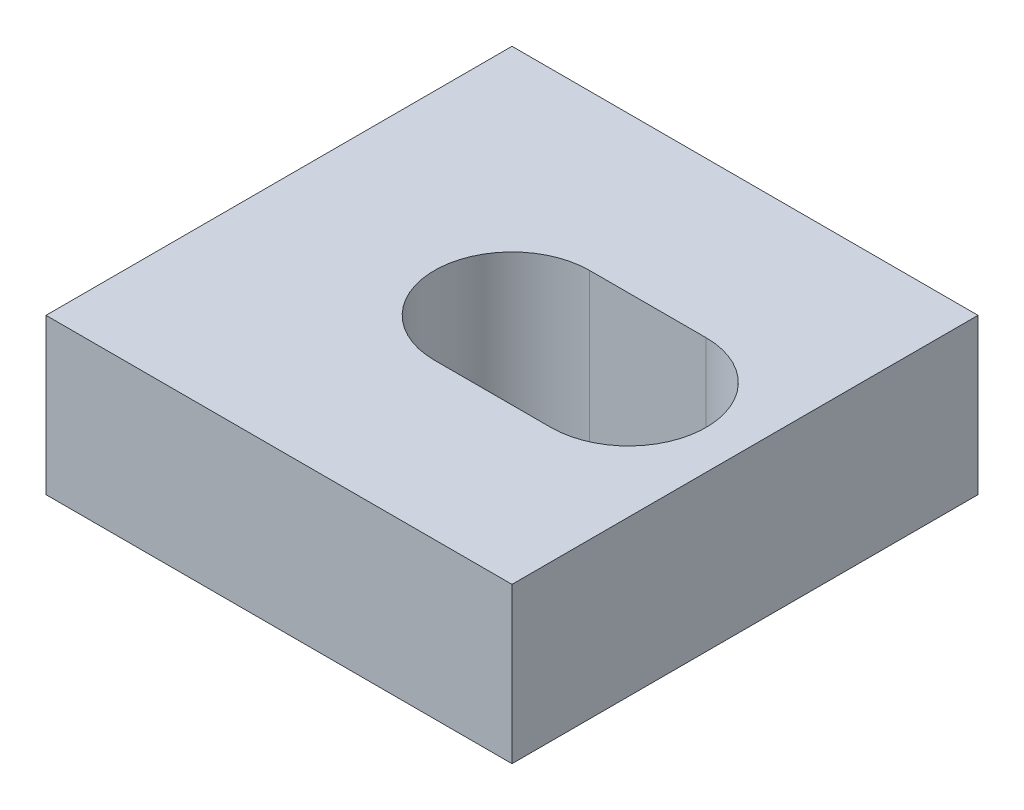
ISO-10303-21;
HEADER;
FILE_DESCRIPTION(('STEP AP214'),'2;1');
FILE_NAME('part.step','',(''),(''),'','','');
FILE_SCHEMA(('AUTOMOTIVE_DESIGN { 1 0 10303 214 1 1 1 1 }'));
ENDSEC;
DATA;
#1=APPLICATION_CONTEXT('core data for automotive mechanical design processes');
#2=APPLICATION_PROTOCOL_DEFINITION('international standard','automotive_design',2000,#1);
#3=PRODUCT_CONTEXT('',#1,'mechanical');
#4=PRODUCT('Part','Part','',(#3));
#5=PRODUCT_RELATED_PRODUCT_CATEGORY('part','',(#4));
#6=PRODUCT_DEFINITION_FORMATION('','',#4);
#7=PRODUCT_DEFINITION_CONTEXT('part definition',#1,'design');
#8=PRODUCT_DEFINITION('design','',#6,#7);
#9=PRODUCT_DEFINITION_SHAPE('','',#8);
#10=(LENGTH_UNIT() NAMED_UNIT(*) SI_UNIT(.MILLI.,.METRE.));
#11=(NAMED_UNIT(*) PLANE_ANGLE_UNIT() SI_UNIT($,.RADIAN.));
#12=(NAMED_UNIT(*) SI_UNIT($,.STERADIAN.) SOLID_ANGLE_UNIT());
#13=UNCERTAINTY_MEASURE_WITH_UNIT(LENGTH_MEASURE(1.E-05),#10,'distance_accuracy_value','');
#14=(GEOMETRIC_REPRESENTATION_CONTEXT(3) GLOBAL_UNCERTAINTY_ASSIGNED_CONTEXT((#13)) GLOBAL_UNIT_ASSIGNED_CONTEXT((#10,
#11,#12)) REPRESENTATION_CONTEXT('',''));
#15=CARTESIAN_POINT('',(0.,0.,0.));
#16=DIRECTION('',(0.,0.,1.));
#17=DIRECTION('',(1.,0.,0.));
#18=AXIS2_PLACEMENT_3D('',#15,#16,#17);
#19=CARTESIAN_POINT('',(0.,20.,0.));
#20=DIRECTION('',(0.,1.,0.));
#21=DIRECTION('',(0.,0.,1.));
#22=AXIS2_PLACEMENT_3D('',#19,#20,#21);
#23=PLANE('',#22);
#24=CARTESIAN_POINT('',(0.,20.,0.));
#25=DIRECTION('',(0.,1.,0.));
#26=DIRECTION('',(0.,0.,1.));
#27=AXIS2_PLACEMENT_3D('',#24,#25,#26);
#28=CIRCLE('',#27,10.);
#29=CARTESIAN_POINT('',(0.,20.,9.99999999999999));
#30=VERTEX_POINT('',#29);
#31=CARTESIAN_POINT('',(0.,20.,-9.99999999999999));
#32=VERTEX_POINT('',#31);
#33=EDGE_CURVE('E119',#30,#32,#28,.F.);
#34=ORIENTED_EDGE('',*,*,#33,.T.);
#35=DIRECTION('',(1.,0.,0.));
#36=VECTOR('',#35,1.);
#37=CARTESIAN_POINT('',(0.,20.,-9.99999999999999));
#38=LINE('',#37,#36);
#39=CARTESIAN_POINT('',(15.,20.,-9.99999999999999));
#40=VERTEX_POINT('',#39);
#41=EDGE_CURVE('E60',#40,#32,#38,.F.);
#42=ORIENTED_EDGE('',*,*,#41,.F.);
#43=CARTESIAN_POINT('',(15.,20.,0.));
#44=DIRECTION('',(0.,1.,0.));
#45=DIRECTION('',(0.,0.,1.));
#46=AXIS2_PLACEMENT_3D('',#43,#44,#45);
#47=CIRCLE('',#46,10.);
#48=CARTESIAN_POINT('',(15.,20.,9.99999999999999));
#49=VERTEX_POINT('',#48);
#50=EDGE_CURVE('E19',#40,#49,#47,.F.);
#51=ORIENTED_EDGE('',*,*,#50,.T.);
#52=DIRECTION('',(-1.,0.,0.));
#53=VECTOR('',#52,1.);
#54=CARTESIAN_POINT('',(15.,20.,9.99999999999999));
#55=LINE('',#54,#53);
#56=EDGE_CURVE('E113',#30,#49,#55,.F.);
#57=ORIENTED_EDGE('',*,*,#56,.F.);
#58=EDGE_LOOP('',(#34,#42,#51,#57));
#59=FACE_BOUND('',#58,.T.);
#60=DIRECTION('',(-1.,0.,0.));
#61=VECTOR('',#60,1.);
#62=CARTESIAN_POINT('',(30.,20.,-30.0000000000002));
#63=LINE('',#62,#61);
#64=CARTESIAN_POINT('',(-30.,20.,-30.0000000000002));
#65=VERTEX_POINT('',#64);
#66=CARTESIAN_POINT('',(30.,20.,-30.0000000000002));
#67=VERTEX_POINT('',#66);
#68=EDGE_CURVE('E70',#65,#67,#63,.F.);
#69=ORIENTED_EDGE('',*,*,#68,.F.);
#70=DIRECTION('',(0.,0.,1.));
#71=VECTOR('',#70,1.);
#72=CARTESIAN_POINT('',(-30.,20.,-30.0000000000002));
#73=LINE('',#72,#71);
#74=CARTESIAN_POINT('',(-30.,20.,30.));
#75=VERTEX_POINT('',#74);
#76=EDGE_CURVE('E97',#75,#65,#73,.F.);
#77=ORIENTED_EDGE('',*,*,#76,.F.);
#78=DIRECTION('',(1.,0.,0.));
#79=VECTOR('',#78,1.);
#80=CARTESIAN_POINT('',(-30.,20.,30.));
#81=LINE('',#80,#79);
#82=CARTESIAN_POINT('',(30.,20.,29.9999999999997));
#83=VERTEX_POINT('',#82);
#84=EDGE_CURVE('E88',#83,#75,#81,.F.);
#85=ORIENTED_EDGE('',*,*,#84,.F.);
#86=DIRECTION('',(0.,0.,-1.));
#87=VECTOR('',#86,1.);
#88=CARTESIAN_POINT('',(30.,20.,29.9999999999997));
#89=LINE('',#88,#87);
#90=EDGE_CURVE('E82',#67,#83,#89,.F.);
#91=ORIENTED_EDGE('',*,*,#90,.F.);
#92=EDGE_LOOP('',(#69,#77,#85,#91));
#93=FACE_BOUND('',#92,.T.);
#94=ADVANCED_FACE('F16',(#59,#93),#23,.T.);
#95=CARTESIAN_POINT('',(-30.,0.,-30.0000000000002));
#96=DIRECTION('',(-1.,0.,0.));
#97=DIRECTION('',(0.,0.,1.));
#98=AXIS2_PLACEMENT_3D('',#95,#96,#97);
#99=PLANE('',#98);
#100=DIRECTION('',(0.,1.,0.));
#101=VECTOR('',#100,1.);
#102=CARTESIAN_POINT('',(-30.,0.,-30.0000000000002));
#103=LINE('',#102,#101);
#104=CARTESIAN_POINT('',(-30.,0.,-30.0000000000002));
#105=VERTEX_POINT('',#104);
#106=EDGE_CURVE('E133',#105,#65,#103,.T.);
#107=ORIENTED_EDGE('',*,*,#106,.F.);
#108=DIRECTION('',(0.,0.,1.));
#109=VECTOR('',#108,1.);
#110=CARTESIAN_POINT('',(-30.,0.,0.));
#111=LINE('',#110,#109);
#112=CARTESIAN_POINT('',(-30.,0.,30.));
#113=VERTEX_POINT('',#112);
#114=EDGE_CURVE('E105',#105,#113,#111,.T.);
#115=ORIENTED_EDGE('',*,*,#114,.T.);
#116=DIRECTION('',(0.,1.,0.));
#117=VECTOR('',#116,1.);
#118=CARTESIAN_POINT('',(-30.,0.,30.));
#119=LINE('',#118,#117);
#120=EDGE_CURVE('E93',#75,#113,#119,.F.);
#121=ORIENTED_EDGE('',*,*,#120,.F.);
#122=ORIENTED_EDGE('',*,*,#76,.T.);
#123=EDGE_LOOP('',(#107,#115,#121,#122));
#124=FACE_BOUND('',#123,.T.);
#125=ADVANCED_FACE('F103',(#124),#99,.T.);
#126=CARTESIAN_POINT('',(-30.,0.,30.));
#127=DIRECTION('',(0.,0.,1.));
#128=DIRECTION('',(1.,0.,0.));
#129=AXIS2_PLACEMENT_3D('',#126,#127,#128);
#130=PLANE('',#129);
#131=ORIENTED_EDGE('',*,*,#120,.T.);
#132=DIRECTION('',(1.,0.,0.));
#133=VECTOR('',#132,1.);
#134=CARTESIAN_POINT('',(0.,0.,30.));
#135=LINE('',#134,#133);
#136=CARTESIAN_POINT('',(30.,0.,29.9999999999997));
#137=VERTEX_POINT('',#136);
#138=EDGE_CURVE('E143',#113,#137,#135,.T.);
#139=ORIENTED_EDGE('',*,*,#138,.T.);
#140=DIRECTION('',(0.,1.,0.));
#141=VECTOR('',#140,1.);
#142=CARTESIAN_POINT('',(30.,0.,29.9999999999997));
#143=LINE('',#142,#141);
#144=EDGE_CURVE('E95',#83,#137,#143,.F.);
#145=ORIENTED_EDGE('',*,*,#144,.F.);
#146=ORIENTED_EDGE('',*,*,#84,.T.);
#147=EDGE_LOOP('',(#131,#139,#145,#146));
#148=FACE_BOUND('',#147,.T.);
#149=ADVANCED_FACE('F90',(#148),#130,.T.);
#150=CARTESIAN_POINT('',(30.,0.,29.9999999999997));
#151=DIRECTION('',(1.,0.,0.));
#152=DIRECTION('',(0.,0.,-1.));
#153=AXIS2_PLACEMENT_3D('',#150,#151,#152);
#154=PLANE('',#153);
#155=ORIENTED_EDGE('',*,*,#144,.T.);
#156=DIRECTION('',(0.,0.,1.));
#157=VECTOR('',#156,1.);
#158=CARTESIAN_POINT('',(30.,0.,-3.05311331771918E-13));
#159=LINE('',#158,#157);
#160=CARTESIAN_POINT('',(30.,0.,-30.0000000000002));
#161=VERTEX_POINT('',#160);
#162=EDGE_CURVE('E138',#137,#161,#159,.F.);
#163=ORIENTED_EDGE('',*,*,#162,.T.);
#164=DIRECTION('',(0.,1.,0.));
#165=VECTOR('',#164,1.);
#166=CARTESIAN_POINT('',(30.,0.,-30.0000000000002));
#167=LINE('',#166,#165);
#168=EDGE_CURVE('E112',#67,#161,#167,.F.);
#169=ORIENTED_EDGE('',*,*,#168,.F.);
#170=ORIENTED_EDGE('',*,*,#90,.T.);
#171=EDGE_LOOP('',(#155,#163,#169,#170));
#172=FACE_BOUND('',#171,.T.);
#173=ADVANCED_FACE('F137',(#172),#154,.T.);
#174=CARTESIAN_POINT('',(30.,0.,-30.0000000000002));
#175=DIRECTION('',(0.,0.,-1.));
#176=DIRECTION('',(-1.,0.,0.));
#177=AXIS2_PLACEMENT_3D('',#174,#175,#176);
#178=PLANE('',#177);
#179=ORIENTED_EDGE('',*,*,#168,.T.);
#180=DIRECTION('',(1.,0.,0.));
#181=VECTOR('',#180,1.);
#182=CARTESIAN_POINT('',(0.,0.,-30.0000000000002));
#183=LINE('',#182,#181);
#184=EDGE_CURVE('E145',#161,#105,#183,.F.);
#185=ORIENTED_EDGE('',*,*,#184,.T.);
#186=ORIENTED_EDGE('',*,*,#106,.T.);
#187=ORIENTED_EDGE('',*,*,#68,.T.);
#188=EDGE_LOOP('',(#179,#185,#186,#187));
#189=FACE_BOUND('',#188,.T.);
#190=ADVANCED_FACE('F177',(#189),#178,.T.);
#191=CARTESIAN_POINT('',(0.,0.,-9.99999999999999));
#192=DIRECTION('',(0.,0.,1.));
#193=DIRECTION('',(1.,0.,0.));
#194=AXIS2_PLACEMENT_3D('',#191,#192,#193);
#195=PLANE('',#194);
#196=DIRECTION('',(0.,1.,0.));
#197=VECTOR('',#196,1.);
#198=CARTESIAN_POINT('',(0.,0.,-9.99999999999999));
#199=LINE('',#198,#197);
#200=CARTESIAN_POINT('',(0.,0.,-9.99999999999999));
#201=VERTEX_POINT('',#200);
#202=EDGE_CURVE('E120',#32,#201,#199,.F.);
#203=ORIENTED_EDGE('',*,*,#202,.T.);
#204=DIRECTION('',(1.,0.,0.));
#205=VECTOR('',#204,1.);
#206=CARTESIAN_POINT('',(0.,0.,-9.99999999999999));
#207=LINE('',#206,#205);
#208=CARTESIAN_POINT('',(15.,0.,-9.99999999999999));
#209=VERTEX_POINT('',#208);
#210=EDGE_CURVE('E118',#201,#209,#207,.T.);
#211=ORIENTED_EDGE('',*,*,#210,.T.);
#212=DIRECTION('',(0.,1.,0.));
#213=VECTOR('',#212,1.);
#214=CARTESIAN_POINT('',(15.,0.,-9.99999999999999));
#215=LINE('',#214,#213);
#216=EDGE_CURVE('E111',#209,#40,#215,.T.);
#217=ORIENTED_EDGE('',*,*,#216,.T.);
#218=ORIENTED_EDGE('',*,*,#41,.T.);
#219=EDGE_LOOP('',(#203,#211,#217,#218));
#220=FACE_BOUND('',#219,.T.);
#221=ADVANCED_FACE('F160',(#220),#195,.T.);
#222=CARTESIAN_POINT('',(15.,0.,0.));
#223=DIRECTION('',(0.,1.,0.));
#224=DIRECTION('',(0.,0.,1.));
#225=AXIS2_PLACEMENT_3D('',#222,#223,#224);
#226=CYLINDRICAL_SURFACE('',#225,10.);
#227=ORIENTED_EDGE('',*,*,#50,.F.);
#228=ORIENTED_EDGE('',*,*,#216,.F.);
#229=CARTESIAN_POINT('',(15.,0.,0.));
#230=DIRECTION('',(0.,1.,0.));
#231=DIRECTION('',(0.,0.,1.));
#232=AXIS2_PLACEMENT_3D('',#229,#230,#231);
#233=CIRCLE('',#232,10.);
#234=CARTESIAN_POINT('',(15.,0.,9.99999999999999));
#235=VERTEX_POINT('',#234);
#236=EDGE_CURVE('E116',#209,#235,#233,.F.);
#237=ORIENTED_EDGE('',*,*,#236,.T.);
#238=DIRECTION('',(0.,1.,0.));
#239=VECTOR('',#238,1.);
#240=CARTESIAN_POINT('',(15.,0.,9.99999999999999));
#241=LINE('',#240,#239);
#242=EDGE_CURVE('E114',#49,#235,#241,.F.);
#243=ORIENTED_EDGE('',*,*,#242,.F.);
#244=EDGE_LOOP('',(#227,#228,#237,#243));
#245=FACE_BOUND('',#244,.T.);
#246=ADVANCED_FACE('F158',(#245),#226,.F.);
#247=CARTESIAN_POINT('',(15.,0.,9.99999999999999));
#248=DIRECTION('',(0.,0.,-1.));
#249=DIRECTION('',(-1.,0.,0.));
#250=AXIS2_PLACEMENT_3D('',#247,#248,#249);
#251=PLANE('',#250);
#252=ORIENTED_EDGE('',*,*,#242,.T.);
#253=DIRECTION('',(1.,0.,0.));
#254=VECTOR('',#253,1.);
#255=CARTESIAN_POINT('',(0.,0.,9.99999999999999));
#256=LINE('',#255,#254);
#257=CARTESIAN_POINT('',(0.,0.,9.99999999999999));
#258=VERTEX_POINT('',#257);
#259=EDGE_CURVE('E25',#235,#258,#256,.F.);
#260=ORIENTED_EDGE('',*,*,#259,.T.);
#261=DIRECTION('',(0.,1.,0.));
#262=VECTOR('',#261,1.);
#263=CARTESIAN_POINT('',(0.,0.,9.99999999999999));
#264=LINE('',#263,#262);
#265=EDGE_CURVE('E33',#258,#30,#264,.T.);
#266=ORIENTED_EDGE('',*,*,#265,.T.);
#267=ORIENTED_EDGE('',*,*,#56,.T.);
#268=EDGE_LOOP('',(#252,#260,#266,#267));
#269=FACE_BOUND('',#268,.T.);
#270=ADVANCED_FACE('F153',(#269),#251,.T.);
#271=CARTESIAN_POINT('',(0.,0.,0.));
#272=DIRECTION('',(0.,1.,0.));
#273=DIRECTION('',(0.,0.,1.));
#274=AXIS2_PLACEMENT_3D('',#271,#272,#273);
#275=CYLINDRICAL_SURFACE('',#274,10.);
#276=ORIENTED_EDGE('',*,*,#33,.F.);
#277=ORIENTED_EDGE('',*,*,#265,.F.);
#278=CARTESIAN_POINT('',(0.,0.,0.));
#279=DIRECTION('',(0.,1.,0.));
#280=DIRECTION('',(0.,0.,1.));
#281=AXIS2_PLACEMENT_3D('',#278,#279,#280);
#282=CIRCLE('',#281,10.);
#283=EDGE_CURVE('E11',#258,#201,#282,.F.);
#284=ORIENTED_EDGE('',*,*,#283,.T.);
#285=ORIENTED_EDGE('',*,*,#202,.F.);
#286=EDGE_LOOP('',(#276,#277,#284,#285));
#287=FACE_BOUND('',#286,.T.);
#288=ADVANCED_FACE('F162',(#287),#275,.F.);
#289=CARTESIAN_POINT('',(0.,0.,0.));
#290=DIRECTION('',(0.,1.,0.));
#291=DIRECTION('',(0.,0.,1.));
#292=AXIS2_PLACEMENT_3D('',#289,#290,#291);
#293=PLANE('',#292);
#294=ORIENTED_EDGE('',*,*,#259,.F.);
#295=ORIENTED_EDGE('',*,*,#236,.F.);
#296=ORIENTED_EDGE('',*,*,#210,.F.);
#297=ORIENTED_EDGE('',*,*,#283,.F.);
#298=EDGE_LOOP('',(#294,#295,#296,#297));
#299=FACE_BOUND('',#298,.T.);
#300=ORIENTED_EDGE('',*,*,#162,.F.);
#301=ORIENTED_EDGE('',*,*,#138,.F.);
#302=ORIENTED_EDGE('',*,*,#114,.F.);
#303=ORIENTED_EDGE('',*,*,#184,.F.);
#304=EDGE_LOOP('',(#300,#301,#302,#303));
#305=FACE_BOUND('',#304,.T.);
#306=ADVANCED_FACE('F142',(#299,#305),#293,.F.);
#307=CLOSED_SHELL('',(#94,#125,#149,#173,#190,#221,#246,#270,#288,#306));
#308=MANIFOLD_SOLID_BREP('B1',#307);
#309=ADVANCED_BREP_SHAPE_REPRESENTATION('',(#18,#308),#14);
#310=SHAPE_DEFINITION_REPRESENTATION(#9,#309);
ENDSEC;
END-ISO-10303-21;
